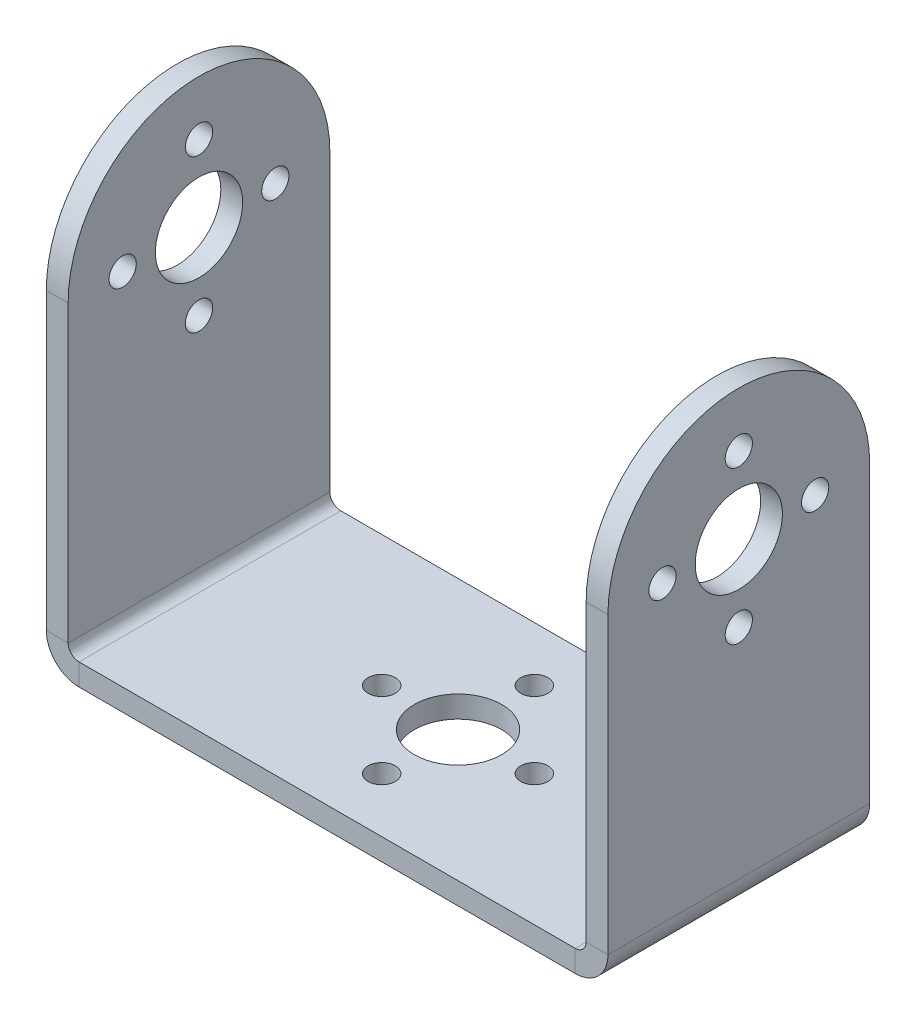
ISO-10303-21;
HEADER;
FILE_DESCRIPTION(('STEP AP214'),'2;1');
FILE_NAME('part.step','',(''),(''),'','','');
FILE_SCHEMA(('AUTOMOTIVE_DESIGN { 1 0 10303 214 1 1 1 1 }'));
ENDSEC;
DATA;
#1=APPLICATION_CONTEXT('core data for automotive mechanical design processes');
#2=APPLICATION_PROTOCOL_DEFINITION('international standard','automotive_design',2000,#1);
#3=PRODUCT_CONTEXT('',#1,'mechanical');
#4=PRODUCT('Part','Part','',(#3));
#5=PRODUCT_RELATED_PRODUCT_CATEGORY('part','',(#4));
#6=PRODUCT_DEFINITION_FORMATION('','',#4);
#7=PRODUCT_DEFINITION_CONTEXT('part definition',#1,'design');
#8=PRODUCT_DEFINITION('design','',#6,#7);
#9=PRODUCT_DEFINITION_SHAPE('','',#8);
#10=(LENGTH_UNIT() NAMED_UNIT(*) SI_UNIT(.MILLI.,.METRE.));
#11=(NAMED_UNIT(*) PLANE_ANGLE_UNIT() SI_UNIT($,.RADIAN.));
#12=(NAMED_UNIT(*) SI_UNIT($,.STERADIAN.) SOLID_ANGLE_UNIT());
#13=UNCERTAINTY_MEASURE_WITH_UNIT(LENGTH_MEASURE(1.E-05),#10,'distance_accuracy_value','');
#14=(GEOMETRIC_REPRESENTATION_CONTEXT(3) GLOBAL_UNCERTAINTY_ASSIGNED_CONTEXT((#13)) GLOBAL_UNIT_ASSIGNED_CONTEXT((#10,
#11,#12)) REPRESENTATION_CONTEXT('',''));
#15=CARTESIAN_POINT('',(0.,0.,0.));
#16=DIRECTION('',(0.,0.,1.));
#17=DIRECTION('',(1.,0.,0.));
#18=AXIS2_PLACEMENT_3D('',#15,#16,#17);
#19=CARTESIAN_POINT('',(25.75,0.,12.));
#20=DIRECTION('',(-1.,0.,0.));
#21=DIRECTION('',(0.,0.,1.));
#22=AXIS2_PLACEMENT_3D('',#19,#20,#21);
#23=PLANE('',#22);
#24=CARTESIAN_POINT('',(25.75,37.,0.));
#25=DIRECTION('',(1.,0.,0.));
#26=DIRECTION('',(0.,0.,-1.));
#27=AXIS2_PLACEMENT_3D('',#24,#25,#26);
#28=CIRCLE('',#27,1.25);
#29=CARTESIAN_POINT('',(25.75,37.,-1.25));
#30=VERTEX_POINT('',#29);
#31=EDGE_CURVE('E353',#30,#30,#28,.T.);
#32=ORIENTED_EDGE('',*,*,#31,.F.);
#33=EDGE_LOOP('',(#32));
#34=FACE_BOUND('',#33,.T.);
#35=CARTESIAN_POINT('',(25.75,30.,-7.));
#36=DIRECTION('',(1.,0.,0.));
#37=DIRECTION('',(0.,0.,-1.));
#38=AXIS2_PLACEMENT_3D('',#35,#36,#37);
#39=CIRCLE('',#38,1.25);
#40=CARTESIAN_POINT('',(25.75,30.,-8.25));
#41=VERTEX_POINT('',#40);
#42=EDGE_CURVE('E341',#41,#41,#39,.T.);
#43=ORIENTED_EDGE('',*,*,#42,.F.);
#44=EDGE_LOOP('',(#43));
#45=FACE_BOUND('',#44,.T.);
#46=CARTESIAN_POINT('',(25.75,23.,0.));
#47=DIRECTION('',(1.,0.,0.));
#48=DIRECTION('',(0.,0.,-1.));
#49=AXIS2_PLACEMENT_3D('',#46,#47,#48);
#50=CIRCLE('',#49,1.25);
#51=CARTESIAN_POINT('',(25.75,23.,-1.25));
#52=VERTEX_POINT('',#51);
#53=EDGE_CURVE('E329',#52,#52,#50,.T.);
#54=ORIENTED_EDGE('',*,*,#53,.F.);
#55=EDGE_LOOP('',(#54));
#56=FACE_BOUND('',#55,.T.);
#57=CARTESIAN_POINT('',(25.75,30.,7.));
#58=DIRECTION('',(1.,0.,0.));
#59=DIRECTION('',(0.,0.,-1.));
#60=AXIS2_PLACEMENT_3D('',#57,#58,#59);
#61=CIRCLE('',#60,1.25);
#62=CARTESIAN_POINT('',(25.75,30.,5.75));
#63=VERTEX_POINT('',#62);
#64=EDGE_CURVE('E317',#63,#63,#61,.T.);
#65=ORIENTED_EDGE('',*,*,#64,.F.);
#66=EDGE_LOOP('',(#65));
#67=FACE_BOUND('',#66,.T.);
#68=CARTESIAN_POINT('',(25.75,30.,0.));
#69=DIRECTION('',(1.,0.,0.));
#70=DIRECTION('',(0.,0.,-1.));
#71=AXIS2_PLACEMENT_3D('',#68,#69,#70);
#72=CIRCLE('',#71,4.);
#73=CARTESIAN_POINT('',(25.75,30.,-4.));
#74=VERTEX_POINT('',#73);
#75=EDGE_CURVE('E305',#74,#74,#72,.T.);
#76=ORIENTED_EDGE('',*,*,#75,.F.);
#77=EDGE_LOOP('',(#76));
#78=FACE_BOUND('',#77,.T.);
#79=DIRECTION('',(0.,1.,0.));
#80=VECTOR('',#79,1.);
#81=CARTESIAN_POINT('',(25.75,0.,-12.));
#82=LINE('',#81,#80);
#83=CARTESIAN_POINT('',(25.75,3.,-12.));
#84=VERTEX_POINT('',#83);
#85=CARTESIAN_POINT('',(25.75,30.,-12.));
#86=VERTEX_POINT('',#85);
#87=EDGE_CURVE('E162',#84,#86,#82,.T.);
#88=ORIENTED_EDGE('',*,*,#87,.T.);
#89=CARTESIAN_POINT('',(25.75,30.,0.));
#90=DIRECTION('',(-1.,0.,0.));
#91=DIRECTION('',(0.,0.,1.));
#92=AXIS2_PLACEMENT_3D('',#89,#90,#91);
#93=CIRCLE('',#92,12.);
#94=CARTESIAN_POINT('',(25.75,30.,12.));
#95=VERTEX_POINT('',#94);
#96=EDGE_CURVE('E270',#86,#95,#93,.F.);
#97=ORIENTED_EDGE('',*,*,#96,.T.);
#98=DIRECTION('',(0.,1.,0.));
#99=VECTOR('',#98,1.);
#100=CARTESIAN_POINT('',(25.75,0.,12.));
#101=LINE('',#100,#99);
#102=CARTESIAN_POINT('',(25.75,3.,12.));
#103=VERTEX_POINT('',#102);
#104=EDGE_CURVE('E186',#103,#95,#101,.T.);
#105=ORIENTED_EDGE('',*,*,#104,.F.);
#106=DIRECTION('',(0.,0.,-1.));
#107=VECTOR('',#106,1.);
#108=CARTESIAN_POINT('',(25.75,3.,12.));
#109=LINE('',#108,#107);
#110=EDGE_CURVE('E158',#103,#84,#109,.T.);
#111=ORIENTED_EDGE('',*,*,#110,.T.);
#112=EDGE_LOOP('',(#88,#97,#105,#111));
#113=FACE_BOUND('',#112,.T.);
#114=ADVANCED_FACE('F37',(#34,#45,#56,#67,#78,#113),#23,.F.);
#115=CARTESIAN_POINT('',(23.75,0.,12.));
#116=DIRECTION('',(-1.,0.,0.));
#117=DIRECTION('',(0.,0.,1.));
#118=AXIS2_PLACEMENT_3D('',#115,#116,#117);
#119=PLANE('',#118);
#120=CARTESIAN_POINT('',(23.75,37.,0.));
#121=DIRECTION('',(-1.,0.,0.));
#122=DIRECTION('',(0.,0.,1.));
#123=AXIS2_PLACEMENT_3D('',#120,#121,#122);
#124=CIRCLE('',#123,1.24999999999999);
#125=CARTESIAN_POINT('',(23.75,37.,1.24999999999999));
#126=VERTEX_POINT('',#125);
#127=EDGE_CURVE('E344',#126,#126,#124,.T.);
#128=ORIENTED_EDGE('',*,*,#127,.F.);
#129=EDGE_LOOP('',(#128));
#130=FACE_BOUND('',#129,.T.);
#131=CARTESIAN_POINT('',(23.75,30.,-7.));
#132=DIRECTION('',(-1.,0.,0.));
#133=DIRECTION('',(0.,0.,1.));
#134=AXIS2_PLACEMENT_3D('',#131,#132,#133);
#135=CIRCLE('',#134,1.24999999999999);
#136=CARTESIAN_POINT('',(23.75,30.,-5.75000000000001));
#137=VERTEX_POINT('',#136);
#138=EDGE_CURVE('E335',#137,#137,#135,.T.);
#139=ORIENTED_EDGE('',*,*,#138,.F.);
#140=EDGE_LOOP('',(#139));
#141=FACE_BOUND('',#140,.T.);
#142=CARTESIAN_POINT('',(23.75,23.,0.));
#143=DIRECTION('',(-1.,0.,0.));
#144=DIRECTION('',(0.,0.,1.));
#145=AXIS2_PLACEMENT_3D('',#142,#143,#144);
#146=CIRCLE('',#145,1.24999999999999);
#147=CARTESIAN_POINT('',(23.75,23.,1.24999999999999));
#148=VERTEX_POINT('',#147);
#149=EDGE_CURVE('E320',#148,#148,#146,.T.);
#150=ORIENTED_EDGE('',*,*,#149,.F.);
#151=EDGE_LOOP('',(#150));
#152=FACE_BOUND('',#151,.T.);
#153=CARTESIAN_POINT('',(23.75,30.,7.));
#154=DIRECTION('',(-1.,0.,0.));
#155=DIRECTION('',(0.,0.,1.));
#156=AXIS2_PLACEMENT_3D('',#153,#154,#155);
#157=CIRCLE('',#156,1.24999999999999);
#158=CARTESIAN_POINT('',(23.75,30.,8.24999999999999));
#159=VERTEX_POINT('',#158);
#160=EDGE_CURVE('E311',#159,#159,#157,.T.);
#161=ORIENTED_EDGE('',*,*,#160,.F.);
#162=EDGE_LOOP('',(#161));
#163=FACE_BOUND('',#162,.T.);
#164=CARTESIAN_POINT('',(23.75,30.,0.));
#165=DIRECTION('',(-1.,0.,0.));
#166=DIRECTION('',(0.,0.,1.));
#167=AXIS2_PLACEMENT_3D('',#164,#165,#166);
#168=CIRCLE('',#167,3.99999999999999);
#169=CARTESIAN_POINT('',(23.75,30.,3.99999999999999));
#170=VERTEX_POINT('',#169);
#171=EDGE_CURVE('E299',#170,#170,#168,.T.);
#172=ORIENTED_EDGE('',*,*,#171,.F.);
#173=EDGE_LOOP('',(#172));
#174=FACE_BOUND('',#173,.T.);
#175=CARTESIAN_POINT('',(23.75,30.,0.));
#176=DIRECTION('',(-1.,0.,0.));
#177=DIRECTION('',(0.,0.,1.));
#178=AXIS2_PLACEMENT_3D('',#175,#176,#177);
#179=CIRCLE('',#178,12.);
#180=CARTESIAN_POINT('',(23.75,30.,-12.));
#181=VERTEX_POINT('',#180);
#182=CARTESIAN_POINT('',(23.75,30.,12.));
#183=VERTEX_POINT('',#182);
#184=EDGE_CURVE('E52',#181,#183,#179,.F.);
#185=ORIENTED_EDGE('',*,*,#184,.F.);
#186=DIRECTION('',(0.,1.,0.));
#187=VECTOR('',#186,1.);
#188=CARTESIAN_POINT('',(23.75,0.,-12.));
#189=LINE('',#188,#187);
#190=CARTESIAN_POINT('',(23.75,3.,-12.));
#191=VERTEX_POINT('',#190);
#192=EDGE_CURVE('E165',#191,#181,#189,.T.);
#193=ORIENTED_EDGE('',*,*,#192,.F.);
#194=DIRECTION('',(0.,0.,-1.));
#195=VECTOR('',#194,1.);
#196=CARTESIAN_POINT('',(23.75,3.,12.));
#197=LINE('',#196,#195);
#198=CARTESIAN_POINT('',(23.75,3.,12.));
#199=VERTEX_POINT('',#198);
#200=EDGE_CURVE('E200',#199,#191,#197,.T.);
#201=ORIENTED_EDGE('',*,*,#200,.F.);
#202=DIRECTION('',(0.,1.,0.));
#203=VECTOR('',#202,1.);
#204=CARTESIAN_POINT('',(23.75,0.,12.));
#205=LINE('',#204,#203);
#206=EDGE_CURVE('E268',#199,#183,#205,.T.);
#207=ORIENTED_EDGE('',*,*,#206,.T.);
#208=EDGE_LOOP('',(#185,#193,#201,#207));
#209=FACE_BOUND('',#208,.T.);
#210=ADVANCED_FACE('F267',(#130,#141,#152,#163,#174,#209),#119,.T.);
#211=CARTESIAN_POINT('',(-23.75,42.,12.));
#212=DIRECTION('',(1.,0.,0.));
#213=DIRECTION('',(0.,0.,-1.));
#214=AXIS2_PLACEMENT_3D('',#211,#212,#213);
#215=PLANE('',#214);
#216=CARTESIAN_POINT('',(-23.75,37.,0.));
#217=DIRECTION('',(1.,0.,0.));
#218=DIRECTION('',(0.,0.,-1.));
#219=AXIS2_PLACEMENT_3D('',#216,#217,#218);
#220=CIRCLE('',#219,1.24999999999999);
#221=CARTESIAN_POINT('',(-23.75,37.,-1.24999999999999));
#222=VERTEX_POINT('',#221);
#223=EDGE_CURVE('E347',#222,#222,#220,.T.);
#224=ORIENTED_EDGE('',*,*,#223,.F.);
#225=EDGE_LOOP('',(#224));
#226=FACE_BOUND('',#225,.T.);
#227=CARTESIAN_POINT('',(-23.75,30.,-7.));
#228=DIRECTION('',(1.,0.,0.));
#229=DIRECTION('',(0.,0.,-1.));
#230=AXIS2_PLACEMENT_3D('',#227,#228,#229);
#231=CIRCLE('',#230,1.24999999999999);
#232=CARTESIAN_POINT('',(-23.75,30.,-8.24999999999999));
#233=VERTEX_POINT('',#232);
#234=EDGE_CURVE('E332',#233,#233,#231,.T.);
#235=ORIENTED_EDGE('',*,*,#234,.F.);
#236=EDGE_LOOP('',(#235));
#237=FACE_BOUND('',#236,.T.);
#238=CARTESIAN_POINT('',(-23.75,23.,0.));
#239=DIRECTION('',(1.,0.,0.));
#240=DIRECTION('',(0.,0.,-1.));
#241=AXIS2_PLACEMENT_3D('',#238,#239,#240);
#242=CIRCLE('',#241,1.24999999999999);
#243=CARTESIAN_POINT('',(-23.75,23.,-1.24999999999999));
#244=VERTEX_POINT('',#243);
#245=EDGE_CURVE('E323',#244,#244,#242,.T.);
#246=ORIENTED_EDGE('',*,*,#245,.F.);
#247=EDGE_LOOP('',(#246));
#248=FACE_BOUND('',#247,.T.);
#249=CARTESIAN_POINT('',(-23.75,30.,7.));
#250=DIRECTION('',(1.,0.,0.));
#251=DIRECTION('',(0.,0.,-1.));
#252=AXIS2_PLACEMENT_3D('',#249,#250,#251);
#253=CIRCLE('',#252,1.24999999999999);
#254=CARTESIAN_POINT('',(-23.75,30.,5.75000000000001));
#255=VERTEX_POINT('',#254);
#256=EDGE_CURVE('E308',#255,#255,#253,.T.);
#257=ORIENTED_EDGE('',*,*,#256,.F.);
#258=EDGE_LOOP('',(#257));
#259=FACE_BOUND('',#258,.T.);
#260=CARTESIAN_POINT('',(-23.75,30.,0.));
#261=DIRECTION('',(1.,0.,0.));
#262=DIRECTION('',(0.,0.,-1.));
#263=AXIS2_PLACEMENT_3D('',#260,#261,#262);
#264=CIRCLE('',#263,3.99999999999999);
#265=CARTESIAN_POINT('',(-23.75,30.,-3.99999999999999));
#266=VERTEX_POINT('',#265);
#267=EDGE_CURVE('E279',#266,#266,#264,.T.);
#268=ORIENTED_EDGE('',*,*,#267,.F.);
#269=EDGE_LOOP('',(#268));
#270=FACE_BOUND('',#269,.T.);
#271=DIRECTION('',(0.,1.,0.));
#272=VECTOR('',#271,1.);
#273=CARTESIAN_POINT('',(-23.75,42.,-12.));
#274=LINE('',#273,#272);
#275=CARTESIAN_POINT('',(-23.75,30.,-12.));
#276=VERTEX_POINT('',#275);
#277=CARTESIAN_POINT('',(-23.75,3.00000000000002,-12.));
#278=VERTEX_POINT('',#277);
#279=EDGE_CURVE('E177',#276,#278,#274,.F.);
#280=ORIENTED_EDGE('',*,*,#279,.F.);
#281=CARTESIAN_POINT('',(-23.75,30.,0.));
#282=DIRECTION('',(1.,0.,0.));
#283=DIRECTION('',(0.,0.,-1.));
#284=AXIS2_PLACEMENT_3D('',#281,#282,#283);
#285=CIRCLE('',#284,12.);
#286=CARTESIAN_POINT('',(-23.75,30.,12.));
#287=VERTEX_POINT('',#286);
#288=EDGE_CURVE('E290',#287,#276,#285,.F.);
#289=ORIENTED_EDGE('',*,*,#288,.F.);
#290=DIRECTION('',(0.,1.,0.));
#291=VECTOR('',#290,1.);
#292=CARTESIAN_POINT('',(-23.75,42.,12.));
#293=LINE('',#292,#291);
#294=CARTESIAN_POINT('',(-23.75,3.00000000000002,12.));
#295=VERTEX_POINT('',#294);
#296=EDGE_CURVE('E235',#287,#295,#293,.F.);
#297=ORIENTED_EDGE('',*,*,#296,.T.);
#298=DIRECTION('',(0.,0.,-1.));
#299=VECTOR('',#298,1.);
#300=CARTESIAN_POINT('',(-23.75,3.00000000000002,12.));
#301=LINE('',#300,#299);
#302=EDGE_CURVE('E191',#295,#278,#301,.T.);
#303=ORIENTED_EDGE('',*,*,#302,.T.);
#304=EDGE_LOOP('',(#280,#289,#297,#303));
#305=FACE_BOUND('',#304,.T.);
#306=ADVANCED_FACE('F231',(#226,#237,#248,#259,#270,#305),#215,.T.);
#307=CARTESIAN_POINT('',(-25.75,42.,12.));
#308=DIRECTION('',(1.,0.,0.));
#309=DIRECTION('',(0.,0.,-1.));
#310=AXIS2_PLACEMENT_3D('',#307,#308,#309);
#311=PLANE('',#310);
#312=CARTESIAN_POINT('',(-25.75,37.,0.));
#313=DIRECTION('',(1.,0.,0.));
#314=DIRECTION('',(0.,0.,-1.));
#315=AXIS2_PLACEMENT_3D('',#312,#313,#314);
#316=CIRCLE('',#315,1.24999999999999);
#317=CARTESIAN_POINT('',(-25.75,37.,-1.24999999999999));
#318=VERTEX_POINT('',#317);
#319=EDGE_CURVE('E350',#318,#318,#316,.T.);
#320=ORIENTED_EDGE('',*,*,#319,.T.);
#321=EDGE_LOOP('',(#320));
#322=FACE_BOUND('',#321,.T.);
#323=CARTESIAN_POINT('',(-25.75,30.,-7.));
#324=DIRECTION('',(1.,0.,0.));
#325=DIRECTION('',(0.,0.,-1.));
#326=AXIS2_PLACEMENT_3D('',#323,#324,#325);
#327=CIRCLE('',#326,1.24999999999999);
#328=CARTESIAN_POINT('',(-25.75,30.,-8.24999999999999));
#329=VERTEX_POINT('',#328);
#330=EDGE_CURVE('E338',#329,#329,#327,.T.);
#331=ORIENTED_EDGE('',*,*,#330,.T.);
#332=EDGE_LOOP('',(#331));
#333=FACE_BOUND('',#332,.T.);
#334=CARTESIAN_POINT('',(-25.75,23.,0.));
#335=DIRECTION('',(1.,0.,0.));
#336=DIRECTION('',(0.,0.,-1.));
#337=AXIS2_PLACEMENT_3D('',#334,#335,#336);
#338=CIRCLE('',#337,1.24999999999999);
#339=CARTESIAN_POINT('',(-25.75,23.,-1.24999999999999));
#340=VERTEX_POINT('',#339);
#341=EDGE_CURVE('E326',#340,#340,#338,.T.);
#342=ORIENTED_EDGE('',*,*,#341,.T.);
#343=EDGE_LOOP('',(#342));
#344=FACE_BOUND('',#343,.T.);
#345=CARTESIAN_POINT('',(-25.75,30.,7.));
#346=DIRECTION('',(1.,0.,0.));
#347=DIRECTION('',(0.,0.,-1.));
#348=AXIS2_PLACEMENT_3D('',#345,#346,#347);
#349=CIRCLE('',#348,1.24999999999999);
#350=CARTESIAN_POINT('',(-25.75,30.,5.75000000000001));
#351=VERTEX_POINT('',#350);
#352=EDGE_CURVE('E314',#351,#351,#349,.T.);
#353=ORIENTED_EDGE('',*,*,#352,.T.);
#354=EDGE_LOOP('',(#353));
#355=FACE_BOUND('',#354,.T.);
#356=CARTESIAN_POINT('',(-25.75,30.,0.));
#357=DIRECTION('',(1.,0.,0.));
#358=DIRECTION('',(0.,0.,-1.));
#359=AXIS2_PLACEMENT_3D('',#356,#357,#358);
#360=CIRCLE('',#359,3.99999999999999);
#361=CARTESIAN_POINT('',(-25.75,30.,-3.99999999999999));
#362=VERTEX_POINT('',#361);
#363=EDGE_CURVE('E302',#362,#362,#360,.T.);
#364=ORIENTED_EDGE('',*,*,#363,.T.);
#365=EDGE_LOOP('',(#364));
#366=FACE_BOUND('',#365,.T.);
#367=CARTESIAN_POINT('',(-25.75,30.,0.));
#368=DIRECTION('',(1.,0.,0.));
#369=DIRECTION('',(0.,0.,-1.));
#370=AXIS2_PLACEMENT_3D('',#367,#368,#369);
#371=CIRCLE('',#370,12.);
#372=CARTESIAN_POINT('',(-25.75,30.,12.));
#373=VERTEX_POINT('',#372);
#374=CARTESIAN_POINT('',(-25.75,30.,-12.));
#375=VERTEX_POINT('',#374);
#376=EDGE_CURVE('E251',#373,#375,#371,.F.);
#377=ORIENTED_EDGE('',*,*,#376,.T.);
#378=DIRECTION('',(0.,-1.,0.));
#379=VECTOR('',#378,1.);
#380=CARTESIAN_POINT('',(-25.75,42.,-12.));
#381=LINE('',#380,#379);
#382=CARTESIAN_POINT('',(-25.75,3.00000000000004,-12.));
#383=VERTEX_POINT('',#382);
#384=EDGE_CURVE('E179',#375,#383,#381,.T.);
#385=ORIENTED_EDGE('',*,*,#384,.T.);
#386=DIRECTION('',(0.,0.,-1.));
#387=VECTOR('',#386,1.);
#388=CARTESIAN_POINT('',(-25.75,3.00000000000004,12.));
#389=LINE('',#388,#387);
#390=CARTESIAN_POINT('',(-25.75,3.00000000000004,12.));
#391=VERTEX_POINT('',#390);
#392=EDGE_CURVE('E150',#391,#383,#389,.T.);
#393=ORIENTED_EDGE('',*,*,#392,.F.);
#394=DIRECTION('',(0.,-1.,0.));
#395=VECTOR('',#394,1.);
#396=CARTESIAN_POINT('',(-25.75,42.,12.));
#397=LINE('',#396,#395);
#398=EDGE_CURVE('E139',#373,#391,#397,.T.);
#399=ORIENTED_EDGE('',*,*,#398,.F.);
#400=EDGE_LOOP('',(#377,#385,#393,#399));
#401=FACE_BOUND('',#400,.T.);
#402=ADVANCED_FACE('F248',(#322,#333,#344,#355,#366,#401),#311,.F.);
#403=CARTESIAN_POINT('',(22.75,3.,12.));
#404=DIRECTION('',(0.,0.,1.));
#405=DIRECTION('',(1.,0.,0.));
#406=AXIS2_PLACEMENT_3D('',#403,#404,#405);
#407=PLANE('',#406);
#408=ORIENTED_EDGE('',*,*,#104,.T.);
#409=DIRECTION('',(1.,0.,0.));
#410=VECTOR('',#409,1.);
#411=CARTESIAN_POINT('',(25.75,30.,12.));
#412=LINE('',#411,#410);
#413=EDGE_CURVE('E269',#95,#183,#412,.F.);
#414=ORIENTED_EDGE('',*,*,#413,.T.);
#415=ORIENTED_EDGE('',*,*,#206,.F.);
#416=DIRECTION('',(1.,0.,0.));
#417=VECTOR('',#416,1.);
#418=CARTESIAN_POINT('',(23.75,3.,12.));
#419=LINE('',#418,#417);
#420=EDGE_CURVE('E61',#199,#103,#419,.T.);
#421=ORIENTED_EDGE('',*,*,#420,.T.);
#422=EDGE_LOOP('',(#408,#414,#415,#421));
#423=FACE_BOUND('',#422,.T.);
#424=ADVANCED_FACE('F285',(#423),#407,.T.);
#425=CARTESIAN_POINT('',(-25.75,3.00000000000004,12.));
#426=DIRECTION('',(0.,0.,1.));
#427=DIRECTION('',(1.,0.,0.));
#428=AXIS2_PLACEMENT_3D('',#425,#426,#427);
#429=PLANE('',#428);
#430=DIRECTION('',(1.,0.,0.));
#431=VECTOR('',#430,1.);
#432=CARTESIAN_POINT('',(-25.75,3.00000000000004,12.));
#433=LINE('',#432,#431);
#434=EDGE_CURVE('E11',#391,#295,#433,.T.);
#435=ORIENTED_EDGE('',*,*,#434,.F.);
#436=CARTESIAN_POINT('',(-22.75,3.00000000000001,12.));
#437=DIRECTION('',(0.,0.,-1.));
#438=DIRECTION('',(-1.,0.,0.));
#439=AXIS2_PLACEMENT_3D('',#436,#437,#438);
#440=CIRCLE('',#439,3.);
#441=CARTESIAN_POINT('',(-22.75,0.,12.));
#442=VERTEX_POINT('',#441);
#443=EDGE_CURVE('E134',#391,#442,#440,.F.);
#444=ORIENTED_EDGE('',*,*,#443,.T.);
#445=DIRECTION('',(0.,-1.,0.));
#446=VECTOR('',#445,1.);
#447=CARTESIAN_POINT('',(-22.75,2.,12.));
#448=LINE('',#447,#446);
#449=CARTESIAN_POINT('',(-22.75,2.,12.));
#450=VERTEX_POINT('',#449);
#451=EDGE_CURVE('E45',#450,#442,#448,.T.);
#452=ORIENTED_EDGE('',*,*,#451,.F.);
#453=CARTESIAN_POINT('',(-22.75,3.00000000000001,12.));
#454=DIRECTION('',(0.,0.,1.));
#455=DIRECTION('',(1.,0.,0.));
#456=AXIS2_PLACEMENT_3D('',#453,#454,#455);
#457=CIRCLE('',#456,1.);
#458=EDGE_CURVE('E220',#295,#450,#457,.T.);
#459=ORIENTED_EDGE('',*,*,#458,.F.);
#460=EDGE_LOOP('',(#435,#444,#452,#459));
#461=FACE_BOUND('',#460,.T.);
#462=ADVANCED_FACE('F39',(#461),#429,.T.);
#463=CARTESIAN_POINT('',(-22.75,2.,12.));
#464=DIRECTION('',(0.,0.,1.));
#465=DIRECTION('',(1.,0.,0.));
#466=AXIS2_PLACEMENT_3D('',#463,#464,#465);
#467=PLANE('',#466);
#468=DIRECTION('',(1.,0.,0.));
#469=VECTOR('',#468,1.);
#470=CARTESIAN_POINT('',(-23.75,30.,12.));
#471=LINE('',#470,#469);
#472=EDGE_CURVE('E166',#287,#373,#471,.F.);
#473=ORIENTED_EDGE('',*,*,#472,.T.);
#474=ORIENTED_EDGE('',*,*,#398,.T.);
#475=ORIENTED_EDGE('',*,*,#434,.T.);
#476=ORIENTED_EDGE('',*,*,#296,.F.);
#477=EDGE_LOOP('',(#473,#474,#475,#476));
#478=FACE_BOUND('',#477,.T.);
#479=ADVANCED_FACE('F244',(#478),#467,.T.);
#480=CARTESIAN_POINT('',(-22.75,0.,-12.));
#481=DIRECTION('',(0.,0.,-1.));
#482=DIRECTION('',(-1.,0.,0.));
#483=AXIS2_PLACEMENT_3D('',#480,#481,#482);
#484=PLANE('',#483);
#485=DIRECTION('',(0.,1.,0.));
#486=VECTOR('',#485,1.);
#487=CARTESIAN_POINT('',(-22.75,0.,-12.));
#488=LINE('',#487,#486);
#489=CARTESIAN_POINT('',(-22.75,0.,-12.));
#490=VERTEX_POINT('',#489);
#491=CARTESIAN_POINT('',(-22.75,2.,-12.));
#492=VERTEX_POINT('',#491);
#493=EDGE_CURVE('E131',#490,#492,#488,.T.);
#494=ORIENTED_EDGE('',*,*,#493,.F.);
#495=CARTESIAN_POINT('',(-22.75,3.00000000000001,-12.));
#496=DIRECTION('',(0.,0.,-1.));
#497=DIRECTION('',(-1.,0.,0.));
#498=AXIS2_PLACEMENT_3D('',#495,#496,#497);
#499=CIRCLE('',#498,3.);
#500=EDGE_CURVE('E146',#383,#490,#499,.F.);
#501=ORIENTED_EDGE('',*,*,#500,.F.);
#502=DIRECTION('',(-1.,0.,0.));
#503=VECTOR('',#502,1.);
#504=CARTESIAN_POINT('',(-23.75,3.00000000000002,-12.));
#505=LINE('',#504,#503);
#506=EDGE_CURVE('E209',#278,#383,#505,.T.);
#507=ORIENTED_EDGE('',*,*,#506,.F.);
#508=CARTESIAN_POINT('',(-22.75,3.00000000000001,-12.));
#509=DIRECTION('',(0.,0.,1.));
#510=DIRECTION('',(1.,0.,0.));
#511=AXIS2_PLACEMENT_3D('',#508,#509,#510);
#512=CIRCLE('',#511,1.);
#513=EDGE_CURVE('E174',#278,#492,#512,.T.);
#514=ORIENTED_EDGE('',*,*,#513,.T.);
#515=EDGE_LOOP('',(#494,#501,#507,#514));
#516=FACE_BOUND('',#515,.T.);
#517=ADVANCED_FACE('F226',(#516),#484,.T.);
#518=CARTESIAN_POINT('',(-23.75,3.00000000000002,-12.));
#519=DIRECTION('',(0.,0.,-1.));
#520=DIRECTION('',(-1.,0.,0.));
#521=AXIS2_PLACEMENT_3D('',#518,#519,#520);
#522=PLANE('',#521);
#523=DIRECTION('',(1.,0.,0.));
#524=VECTOR('',#523,1.);
#525=CARTESIAN_POINT('',(-25.75,0.,-12.));
#526=LINE('',#525,#524);
#527=CARTESIAN_POINT('',(22.75,0.,-12.));
#528=VERTEX_POINT('',#527);
#529=EDGE_CURVE('E182',#490,#528,#526,.T.);
#530=ORIENTED_EDGE('',*,*,#529,.F.);
#531=ORIENTED_EDGE('',*,*,#493,.T.);
#532=DIRECTION('',(1.,0.,0.));
#533=VECTOR('',#532,1.);
#534=CARTESIAN_POINT('',(-25.75,2.,-12.));
#535=LINE('',#534,#533);
#536=CARTESIAN_POINT('',(22.75,2.,-12.));
#537=VERTEX_POINT('',#536);
#538=EDGE_CURVE('E171',#492,#537,#535,.T.);
#539=ORIENTED_EDGE('',*,*,#538,.T.);
#540=DIRECTION('',(0.,-1.,0.));
#541=VECTOR('',#540,1.);
#542=CARTESIAN_POINT('',(22.75,2.,-12.));
#543=LINE('',#542,#541);
#544=EDGE_CURVE('E203',#537,#528,#543,.T.);
#545=ORIENTED_EDGE('',*,*,#544,.T.);
#546=EDGE_LOOP('',(#530,#531,#539,#545));
#547=FACE_BOUND('',#546,.T.);
#548=ADVANCED_FACE('F213',(#547),#522,.T.);
#549=CARTESIAN_POINT('',(22.75,0.,12.));
#550=DIRECTION('',(0.,0.,1.));
#551=DIRECTION('',(1.,0.,0.));
#552=AXIS2_PLACEMENT_3D('',#549,#550,#551);
#553=PLANE('',#552);
#554=DIRECTION('',(0.,1.,0.));
#555=VECTOR('',#554,1.);
#556=CARTESIAN_POINT('',(22.75,0.,12.));
#557=LINE('',#556,#555);
#558=CARTESIAN_POINT('',(22.75,0.,12.));
#559=VERTEX_POINT('',#558);
#560=CARTESIAN_POINT('',(22.75,2.,12.));
#561=VERTEX_POINT('',#560);
#562=EDGE_CURVE('E207',#559,#561,#557,.T.);
#563=ORIENTED_EDGE('',*,*,#562,.F.);
#564=CARTESIAN_POINT('',(22.75,3.,12.));
#565=DIRECTION('',(0.,0.,-1.));
#566=DIRECTION('',(-1.,0.,0.));
#567=AXIS2_PLACEMENT_3D('',#564,#565,#566);
#568=CIRCLE('',#567,3.);
#569=EDGE_CURVE('E156',#559,#103,#568,.F.);
#570=ORIENTED_EDGE('',*,*,#569,.T.);
#571=ORIENTED_EDGE('',*,*,#420,.F.);
#572=CARTESIAN_POINT('',(22.75,3.,12.));
#573=DIRECTION('',(0.,0.,1.));
#574=DIRECTION('',(1.,0.,0.));
#575=AXIS2_PLACEMENT_3D('',#572,#573,#574);
#576=CIRCLE('',#575,1.);
#577=EDGE_CURVE('E238',#561,#199,#576,.T.);
#578=ORIENTED_EDGE('',*,*,#577,.F.);
#579=EDGE_LOOP('',(#563,#570,#571,#578));
#580=FACE_BOUND('',#579,.T.);
#581=ADVANCED_FACE('F436',(#580),#553,.T.);
#582=CARTESIAN_POINT('',(23.75,3.,12.));
#583=DIRECTION('',(0.,0.,1.));
#584=DIRECTION('',(1.,0.,0.));
#585=AXIS2_PLACEMENT_3D('',#582,#583,#584);
#586=PLANE('',#585);
#587=DIRECTION('',(1.,0.,0.));
#588=VECTOR('',#587,1.);
#589=CARTESIAN_POINT('',(-25.75,0.,12.));
#590=LINE('',#589,#588);
#591=EDGE_CURVE('E123',#442,#559,#590,.T.);
#592=ORIENTED_EDGE('',*,*,#591,.T.);
#593=ORIENTED_EDGE('',*,*,#562,.T.);
#594=DIRECTION('',(1.,0.,0.));
#595=VECTOR('',#594,1.);
#596=CARTESIAN_POINT('',(-25.75,2.,12.));
#597=LINE('',#596,#595);
#598=EDGE_CURVE('E126',#450,#561,#597,.T.);
#599=ORIENTED_EDGE('',*,*,#598,.F.);
#600=ORIENTED_EDGE('',*,*,#451,.T.);
#601=EDGE_LOOP('',(#592,#593,#599,#600));
#602=FACE_BOUND('',#601,.T.);
#603=ADVANCED_FACE('F121',(#602),#586,.T.);
#604=CARTESIAN_POINT('',(25.75,3.,-12.));
#605=DIRECTION('',(0.,0.,-1.));
#606=DIRECTION('',(-1.,0.,0.));
#607=AXIS2_PLACEMENT_3D('',#604,#605,#606);
#608=PLANE('',#607);
#609=DIRECTION('',(-1.,0.,0.));
#610=VECTOR('',#609,1.);
#611=CARTESIAN_POINT('',(25.75,3.,-12.));
#612=LINE('',#611,#610);
#613=EDGE_CURVE('E95',#84,#191,#612,.T.);
#614=ORIENTED_EDGE('',*,*,#613,.F.);
#615=CARTESIAN_POINT('',(22.75,3.,-12.));
#616=DIRECTION('',(0.,0.,-1.));
#617=DIRECTION('',(-1.,0.,0.));
#618=AXIS2_PLACEMENT_3D('',#615,#616,#617);
#619=CIRCLE('',#618,3.);
#620=EDGE_CURVE('E184',#528,#84,#619,.F.);
#621=ORIENTED_EDGE('',*,*,#620,.F.);
#622=ORIENTED_EDGE('',*,*,#544,.F.);
#623=CARTESIAN_POINT('',(22.75,3.,-12.));
#624=DIRECTION('',(0.,0.,1.));
#625=DIRECTION('',(1.,0.,0.));
#626=AXIS2_PLACEMENT_3D('',#623,#624,#625);
#627=CIRCLE('',#626,1.);
#628=EDGE_CURVE('E169',#537,#191,#627,.T.);
#629=ORIENTED_EDGE('',*,*,#628,.T.);
#630=EDGE_LOOP('',(#614,#621,#622,#629));
#631=FACE_BOUND('',#630,.T.);
#632=ADVANCED_FACE('F431',(#631),#608,.T.);
#633=CARTESIAN_POINT('',(22.75,2.,-12.));
#634=DIRECTION('',(0.,0.,-1.));
#635=DIRECTION('',(-1.,0.,0.));
#636=AXIS2_PLACEMENT_3D('',#633,#634,#635);
#637=PLANE('',#636);
#638=DIRECTION('',(-1.,0.,0.));
#639=VECTOR('',#638,1.);
#640=CARTESIAN_POINT('',(23.75,30.,-12.));
#641=LINE('',#640,#639);
#642=EDGE_CURVE('E273',#181,#86,#641,.F.);
#643=ORIENTED_EDGE('',*,*,#642,.T.);
#644=ORIENTED_EDGE('',*,*,#87,.F.);
#645=ORIENTED_EDGE('',*,*,#613,.T.);
#646=ORIENTED_EDGE('',*,*,#192,.T.);
#647=EDGE_LOOP('',(#643,#644,#645,#646));
#648=FACE_BOUND('',#647,.T.);
#649=ADVANCED_FACE('F281',(#648),#637,.T.);
#650=CARTESIAN_POINT('',(22.75,3.,12.));
#651=DIRECTION('',(0.,0.,-1.));
#652=DIRECTION('',(-1.,0.,0.));
#653=AXIS2_PLACEMENT_3D('',#650,#651,#652);
#654=CYLINDRICAL_SURFACE('',#653,1.);
#655=ORIENTED_EDGE('',*,*,#628,.F.);
#656=DIRECTION('',(0.,0.,-1.));
#657=VECTOR('',#656,1.);
#658=CARTESIAN_POINT('',(22.75,2.,12.));
#659=LINE('',#658,#657);
#660=EDGE_CURVE('E197',#561,#537,#659,.T.);
#661=ORIENTED_EDGE('',*,*,#660,.F.);
#662=ORIENTED_EDGE('',*,*,#577,.T.);
#663=ORIENTED_EDGE('',*,*,#200,.T.);
#664=EDGE_LOOP('',(#655,#661,#662,#663));
#665=FACE_BOUND('',#664,.T.);
#666=ADVANCED_FACE('F284',(#665),#654,.F.);
#667=CARTESIAN_POINT('',(-25.75,2.,12.));
#668=DIRECTION('',(0.,1.,0.));
#669=DIRECTION('',(0.,0.,1.));
#670=AXIS2_PLACEMENT_3D('',#667,#668,#669);
#671=PLANE('',#670);
#672=CARTESIAN_POINT('',(0.,2.,-7.));
#673=DIRECTION('',(0.,1.,0.));
#674=DIRECTION('',(0.,0.,1.));
#675=AXIS2_PLACEMENT_3D('',#672,#673,#674);
#676=CIRCLE('',#675,1.25);
#677=CARTESIAN_POINT('',(0.,2.,-5.75));
#678=VERTEX_POINT('',#677);
#679=EDGE_CURVE('E383',#678,#678,#676,.T.);
#680=ORIENTED_EDGE('',*,*,#679,.F.);
#681=EDGE_LOOP('',(#680));
#682=FACE_BOUND('',#681,.T.);
#683=CARTESIAN_POINT('',(7.,2.,0.));
#684=DIRECTION('',(0.,1.,0.));
#685=DIRECTION('',(0.,0.,1.));
#686=AXIS2_PLACEMENT_3D('',#683,#684,#685);
#687=CIRCLE('',#686,1.25);
#688=CARTESIAN_POINT('',(7.,2.,1.25));
#689=VERTEX_POINT('',#688);
#690=EDGE_CURVE('E377',#689,#689,#687,.T.);
#691=ORIENTED_EDGE('',*,*,#690,.F.);
#692=EDGE_LOOP('',(#691));
#693=FACE_BOUND('',#692,.T.);
#694=CARTESIAN_POINT('',(0.,2.,7.));
#695=DIRECTION('',(0.,1.,0.));
#696=DIRECTION('',(0.,0.,1.));
#697=AXIS2_PLACEMENT_3D('',#694,#695,#696);
#698=CIRCLE('',#697,1.25);
#699=CARTESIAN_POINT('',(0.,2.,8.25));
#700=VERTEX_POINT('',#699);
#701=EDGE_CURVE('E371',#700,#700,#698,.T.);
#702=ORIENTED_EDGE('',*,*,#701,.F.);
#703=EDGE_LOOP('',(#702));
#704=FACE_BOUND('',#703,.T.);
#705=CARTESIAN_POINT('',(-7.,2.,0.));
#706=DIRECTION('',(0.,1.,0.));
#707=DIRECTION('',(0.,0.,1.));
#708=AXIS2_PLACEMENT_3D('',#705,#706,#707);
#709=CIRCLE('',#708,1.25);
#710=CARTESIAN_POINT('',(-7.,2.,1.25));
#711=VERTEX_POINT('',#710);
#712=EDGE_CURVE('E365',#711,#711,#709,.T.);
#713=ORIENTED_EDGE('',*,*,#712,.F.);
#714=EDGE_LOOP('',(#713));
#715=FACE_BOUND('',#714,.T.);
#716=CARTESIAN_POINT('',(0.,2.,0.));
#717=DIRECTION('',(0.,1.,0.));
#718=DIRECTION('',(0.,0.,1.));
#719=AXIS2_PLACEMENT_3D('',#716,#717,#718);
#720=CIRCLE('',#719,4.);
#721=CARTESIAN_POINT('',(0.,2.,4.));
#722=VERTEX_POINT('',#721);
#723=EDGE_CURVE('E359',#722,#722,#720,.T.);
#724=ORIENTED_EDGE('',*,*,#723,.F.);
#725=EDGE_LOOP('',(#724));
#726=FACE_BOUND('',#725,.T.);
#727=ORIENTED_EDGE('',*,*,#538,.F.);
#728=DIRECTION('',(0.,0.,-1.));
#729=VECTOR('',#728,1.);
#730=CARTESIAN_POINT('',(-22.75,2.,12.));
#731=LINE('',#730,#729);
#732=EDGE_CURVE('E194',#450,#492,#731,.T.);
#733=ORIENTED_EDGE('',*,*,#732,.F.);
#734=ORIENTED_EDGE('',*,*,#598,.T.);
#735=ORIENTED_EDGE('',*,*,#660,.T.);
#736=EDGE_LOOP('',(#727,#733,#734,#735));
#737=FACE_BOUND('',#736,.T.);
#738=ADVANCED_FACE('F222',(#682,#693,#704,#715,#726,#737),#671,.T.);
#739=CARTESIAN_POINT('',(-22.75,3.00000000000001,12.));
#740=DIRECTION('',(0.,0.,-1.));
#741=DIRECTION('',(-1.,0.,0.));
#742=AXIS2_PLACEMENT_3D('',#739,#740,#741);
#743=CYLINDRICAL_SURFACE('',#742,1.);
#744=ORIENTED_EDGE('',*,*,#513,.F.);
#745=ORIENTED_EDGE('',*,*,#302,.F.);
#746=ORIENTED_EDGE('',*,*,#458,.T.);
#747=ORIENTED_EDGE('',*,*,#732,.T.);
#748=EDGE_LOOP('',(#744,#745,#746,#747));
#749=FACE_BOUND('',#748,.T.);
#750=ADVANCED_FACE('F218',(#749),#743,.F.);
#751=CARTESIAN_POINT('',(-22.75,3.00000000000001,12.));
#752=DIRECTION('',(0.,0.,-1.));
#753=DIRECTION('',(-1.,0.,0.));
#754=AXIS2_PLACEMENT_3D('',#751,#752,#753);
#755=CYLINDRICAL_SURFACE('',#754,3.);
#756=ORIENTED_EDGE('',*,*,#500,.T.);
#757=DIRECTION('',(0.,0.,-1.));
#758=VECTOR('',#757,1.);
#759=CARTESIAN_POINT('',(-22.75,0.,12.));
#760=LINE('',#759,#758);
#761=EDGE_CURVE('E143',#442,#490,#760,.T.);
#762=ORIENTED_EDGE('',*,*,#761,.F.);
#763=ORIENTED_EDGE('',*,*,#443,.F.);
#764=ORIENTED_EDGE('',*,*,#392,.T.);
#765=EDGE_LOOP('',(#756,#762,#763,#764));
#766=FACE_BOUND('',#765,.T.);
#767=ADVANCED_FACE('F144',(#766),#755,.T.);
#768=CARTESIAN_POINT('',(-25.75,0.,12.));
#769=DIRECTION('',(0.,1.,0.));
#770=DIRECTION('',(0.,0.,1.));
#771=AXIS2_PLACEMENT_3D('',#768,#769,#770);
#772=PLANE('',#771);
#773=CARTESIAN_POINT('',(0.,0.,-7.));
#774=DIRECTION('',(0.,1.,0.));
#775=DIRECTION('',(0.,0.,1.));
#776=AXIS2_PLACEMENT_3D('',#773,#774,#775);
#777=CIRCLE('',#776,1.25);
#778=CARTESIAN_POINT('',(0.,0.,-5.75));
#779=VERTEX_POINT('',#778);
#780=EDGE_CURVE('E380',#779,#779,#777,.T.);
#781=ORIENTED_EDGE('',*,*,#780,.T.);
#782=EDGE_LOOP('',(#781));
#783=FACE_BOUND('',#782,.T.);
#784=CARTESIAN_POINT('',(7.,0.,0.));
#785=DIRECTION('',(0.,1.,0.));
#786=DIRECTION('',(0.,0.,1.));
#787=AXIS2_PLACEMENT_3D('',#784,#785,#786);
#788=CIRCLE('',#787,1.25);
#789=CARTESIAN_POINT('',(7.,0.,1.25));
#790=VERTEX_POINT('',#789);
#791=EDGE_CURVE('E374',#790,#790,#788,.T.);
#792=ORIENTED_EDGE('',*,*,#791,.T.);
#793=EDGE_LOOP('',(#792));
#794=FACE_BOUND('',#793,.T.);
#795=CARTESIAN_POINT('',(0.,0.,7.));
#796=DIRECTION('',(0.,1.,0.));
#797=DIRECTION('',(0.,0.,1.));
#798=AXIS2_PLACEMENT_3D('',#795,#796,#797);
#799=CIRCLE('',#798,1.25);
#800=CARTESIAN_POINT('',(0.,0.,8.25));
#801=VERTEX_POINT('',#800);
#802=EDGE_CURVE('E368',#801,#801,#799,.T.);
#803=ORIENTED_EDGE('',*,*,#802,.T.);
#804=EDGE_LOOP('',(#803));
#805=FACE_BOUND('',#804,.T.);
#806=CARTESIAN_POINT('',(-7.,0.,0.));
#807=DIRECTION('',(0.,1.,0.));
#808=DIRECTION('',(0.,0.,1.));
#809=AXIS2_PLACEMENT_3D('',#806,#807,#808);
#810=CIRCLE('',#809,1.25);
#811=CARTESIAN_POINT('',(-7.,0.,1.25));
#812=VERTEX_POINT('',#811);
#813=EDGE_CURVE('E362',#812,#812,#810,.T.);
#814=ORIENTED_EDGE('',*,*,#813,.T.);
#815=EDGE_LOOP('',(#814));
#816=FACE_BOUND('',#815,.T.);
#817=CARTESIAN_POINT('',(0.,0.,0.));
#818=DIRECTION('',(0.,1.,0.));
#819=DIRECTION('',(0.,0.,1.));
#820=AXIS2_PLACEMENT_3D('',#817,#818,#819);
#821=CIRCLE('',#820,4.);
#822=CARTESIAN_POINT('',(0.,0.,4.));
#823=VERTEX_POINT('',#822);
#824=EDGE_CURVE('E356',#823,#823,#821,.T.);
#825=ORIENTED_EDGE('',*,*,#824,.T.);
#826=EDGE_LOOP('',(#825));
#827=FACE_BOUND('',#826,.T.);
#828=ORIENTED_EDGE('',*,*,#529,.T.);
#829=DIRECTION('',(0.,0.,-1.));
#830=VECTOR('',#829,1.);
#831=CARTESIAN_POINT('',(22.75,0.,12.));
#832=LINE('',#831,#830);
#833=EDGE_CURVE('E151',#559,#528,#832,.T.);
#834=ORIENTED_EDGE('',*,*,#833,.F.);
#835=ORIENTED_EDGE('',*,*,#591,.F.);
#836=ORIENTED_EDGE('',*,*,#761,.T.);
#837=EDGE_LOOP('',(#828,#834,#835,#836));
#838=FACE_BOUND('',#837,.T.);
#839=ADVANCED_FACE('F153',(#783,#794,#805,#816,#827,#838),#772,.F.);
#840=CARTESIAN_POINT('',(22.75,3.,12.));
#841=DIRECTION('',(0.,0.,-1.));
#842=DIRECTION('',(-1.,0.,0.));
#843=AXIS2_PLACEMENT_3D('',#840,#841,#842);
#844=CYLINDRICAL_SURFACE('',#843,3.);
#845=ORIENTED_EDGE('',*,*,#620,.T.);
#846=ORIENTED_EDGE('',*,*,#110,.F.);
#847=ORIENTED_EDGE('',*,*,#569,.F.);
#848=ORIENTED_EDGE('',*,*,#833,.T.);
#849=EDGE_LOOP('',(#845,#846,#847,#848));
#850=FACE_BOUND('',#849,.T.);
#851=ADVANCED_FACE('F462',(#850),#844,.T.);
#852=CARTESIAN_POINT('',(22.75,3.,-12.));
#853=DIRECTION('',(0.,0.,1.));
#854=DIRECTION('',(1.,0.,0.));
#855=AXIS2_PLACEMENT_3D('',#852,#853,#854);
#856=PLANE('',#855);
#857=ORIENTED_EDGE('',*,*,#384,.F.);
#858=DIRECTION('',(-1.,0.,0.));
#859=VECTOR('',#858,1.);
#860=CARTESIAN_POINT('',(-25.75,30.,-12.));
#861=LINE('',#860,#859);
#862=EDGE_CURVE('E278',#375,#276,#861,.F.);
#863=ORIENTED_EDGE('',*,*,#862,.T.);
#864=ORIENTED_EDGE('',*,*,#279,.T.);
#865=ORIENTED_EDGE('',*,*,#506,.T.);
#866=EDGE_LOOP('',(#857,#863,#864,#865));
#867=FACE_BOUND('',#866,.T.);
#868=ADVANCED_FACE('F459',(#867),#856,.F.);
#869=CARTESIAN_POINT('',(-23.75,30.,0.));
#870=DIRECTION('',(1.,0.,0.));
#871=DIRECTION('',(0.,0.,-1.));
#872=AXIS2_PLACEMENT_3D('',#869,#870,#871);
#873=CYLINDRICAL_SURFACE('',#872,12.);
#874=ORIENTED_EDGE('',*,*,#288,.T.);
#875=ORIENTED_EDGE('',*,*,#862,.F.);
#876=ORIENTED_EDGE('',*,*,#376,.F.);
#877=ORIENTED_EDGE('',*,*,#472,.F.);
#878=EDGE_LOOP('',(#874,#875,#876,#877));
#879=FACE_BOUND('',#878,.T.);
#880=ADVANCED_FACE('F457',(#879),#873,.T.);
#881=CARTESIAN_POINT('',(25.75,30.,0.));
#882=DIRECTION('',(-1.,0.,0.));
#883=DIRECTION('',(0.,0.,1.));
#884=AXIS2_PLACEMENT_3D('',#881,#882,#883);
#885=CYLINDRICAL_SURFACE('',#884,12.);
#886=ORIENTED_EDGE('',*,*,#413,.F.);
#887=ORIENTED_EDGE('',*,*,#96,.F.);
#888=ORIENTED_EDGE('',*,*,#642,.F.);
#889=ORIENTED_EDGE('',*,*,#184,.T.);
#890=EDGE_LOOP('',(#886,#887,#888,#889));
#891=FACE_BOUND('',#890,.T.);
#892=ADVANCED_FACE('F274',(#891),#885,.T.);
#893=CARTESIAN_POINT('',(25.75,30.,0.));
#894=DIRECTION('',(1.,0.,0.));
#895=DIRECTION('',(0.,0.,-1.));
#896=AXIS2_PLACEMENT_3D('',#893,#894,#895);
#897=CYLINDRICAL_SURFACE('',#896,3.99999999999999);
#898=ORIENTED_EDGE('',*,*,#267,.T.);
#899=EDGE_LOOP('',(#898));
#900=FACE_BOUND('',#899,.T.);
#901=ORIENTED_EDGE('',*,*,#363,.F.);
#902=EDGE_LOOP('',(#901));
#903=FACE_BOUND('',#902,.T.);
#904=ADVANCED_FACE('F517',(#900,#903),#897,.F.);
#905=ORIENTED_EDGE('',*,*,#171,.T.);
#906=EDGE_LOOP('',(#905));
#907=FACE_BOUND('',#906,.T.);
#908=ORIENTED_EDGE('',*,*,#75,.T.);
#909=EDGE_LOOP('',(#908));
#910=FACE_BOUND('',#909,.T.);
#911=ADVANCED_FACE('F523',(#907,#910),#897,.F.);
#912=CARTESIAN_POINT('',(25.75,30.,7.));
#913=DIRECTION('',(1.,0.,0.));
#914=DIRECTION('',(0.,0.,-1.));
#915=AXIS2_PLACEMENT_3D('',#912,#913,#914);
#916=CYLINDRICAL_SURFACE('',#915,1.24999999999999);
#917=ORIENTED_EDGE('',*,*,#256,.T.);
#918=EDGE_LOOP('',(#917));
#919=FACE_BOUND('',#918,.T.);
#920=ORIENTED_EDGE('',*,*,#352,.F.);
#921=EDGE_LOOP('',(#920));
#922=FACE_BOUND('',#921,.T.);
#923=ADVANCED_FACE('F531',(#919,#922),#916,.F.);
#924=ORIENTED_EDGE('',*,*,#160,.T.);
#925=EDGE_LOOP('',(#924));
#926=FACE_BOUND('',#925,.T.);
#927=ORIENTED_EDGE('',*,*,#64,.T.);
#928=EDGE_LOOP('',(#927));
#929=FACE_BOUND('',#928,.T.);
#930=ADVANCED_FACE('F538',(#926,#929),#916,.F.);
#931=CARTESIAN_POINT('',(25.75,23.,0.));
#932=DIRECTION('',(1.,0.,0.));
#933=DIRECTION('',(0.,0.,-1.));
#934=AXIS2_PLACEMENT_3D('',#931,#932,#933);
#935=CYLINDRICAL_SURFACE('',#934,1.24999999999999);
#936=ORIENTED_EDGE('',*,*,#245,.T.);
#937=EDGE_LOOP('',(#936));
#938=FACE_BOUND('',#937,.T.);
#939=ORIENTED_EDGE('',*,*,#341,.F.);
#940=EDGE_LOOP('',(#939));
#941=FACE_BOUND('',#940,.T.);
#942=ADVANCED_FACE('F547',(#938,#941),#935,.F.);
#943=ORIENTED_EDGE('',*,*,#149,.T.);
#944=EDGE_LOOP('',(#943));
#945=FACE_BOUND('',#944,.T.);
#946=ORIENTED_EDGE('',*,*,#53,.T.);
#947=EDGE_LOOP('',(#946));
#948=FACE_BOUND('',#947,.T.);
#949=ADVANCED_FACE('F554',(#945,#948),#935,.F.);
#950=CARTESIAN_POINT('',(25.75,30.,-7.));
#951=DIRECTION('',(1.,0.,0.));
#952=DIRECTION('',(0.,0.,-1.));
#953=AXIS2_PLACEMENT_3D('',#950,#951,#952);
#954=CYLINDRICAL_SURFACE('',#953,1.24999999999999);
#955=ORIENTED_EDGE('',*,*,#234,.T.);
#956=EDGE_LOOP('',(#955));
#957=FACE_BOUND('',#956,.T.);
#958=ORIENTED_EDGE('',*,*,#330,.F.);
#959=EDGE_LOOP('',(#958));
#960=FACE_BOUND('',#959,.T.);
#961=ADVANCED_FACE('F562',(#957,#960),#954,.F.);
#962=ORIENTED_EDGE('',*,*,#138,.T.);
#963=EDGE_LOOP('',(#962));
#964=FACE_BOUND('',#963,.T.);
#965=ORIENTED_EDGE('',*,*,#42,.T.);
#966=EDGE_LOOP('',(#965));
#967=FACE_BOUND('',#966,.T.);
#968=ADVANCED_FACE('F569',(#964,#967),#954,.F.);
#969=CARTESIAN_POINT('',(25.75,37.,0.));
#970=DIRECTION('',(1.,0.,0.));
#971=DIRECTION('',(0.,0.,-1.));
#972=AXIS2_PLACEMENT_3D('',#969,#970,#971);
#973=CYLINDRICAL_SURFACE('',#972,1.24999999999999);
#974=ORIENTED_EDGE('',*,*,#223,.T.);
#975=EDGE_LOOP('',(#974));
#976=FACE_BOUND('',#975,.T.);
#977=ORIENTED_EDGE('',*,*,#319,.F.);
#978=EDGE_LOOP('',(#977));
#979=FACE_BOUND('',#978,.T.);
#980=ADVANCED_FACE('F413',(#976,#979),#973,.F.);
#981=ORIENTED_EDGE('',*,*,#127,.T.);
#982=EDGE_LOOP('',(#981));
#983=FACE_BOUND('',#982,.T.);
#984=ORIENTED_EDGE('',*,*,#31,.T.);
#985=EDGE_LOOP('',(#984));
#986=FACE_BOUND('',#985,.T.);
#987=ADVANCED_FACE('F403',(#983,#986),#973,.F.);
#988=CARTESIAN_POINT('',(0.,2.,0.));
#989=DIRECTION('',(0.,1.,0.));
#990=DIRECTION('',(0.,0.,1.));
#991=AXIS2_PLACEMENT_3D('',#988,#989,#990);
#992=CYLINDRICAL_SURFACE('',#991,4.);
#993=ORIENTED_EDGE('',*,*,#824,.F.);
#994=EDGE_LOOP('',(#993));
#995=FACE_BOUND('',#994,.T.);
#996=ORIENTED_EDGE('',*,*,#723,.T.);
#997=EDGE_LOOP('',(#996));
#998=FACE_BOUND('',#997,.T.);
#999=ADVANCED_FACE('F400',(#995,#998),#992,.F.);
#1000=CARTESIAN_POINT('',(-7.,2.,0.));
#1001=DIRECTION('',(0.,1.,0.));
#1002=DIRECTION('',(0.,0.,1.));
#1003=AXIS2_PLACEMENT_3D('',#1000,#1001,#1002);
#1004=CYLINDRICAL_SURFACE('',#1003,1.25);
#1005=ORIENTED_EDGE('',*,*,#813,.F.);
#1006=EDGE_LOOP('',(#1005));
#1007=FACE_BOUND('',#1006,.T.);
#1008=ORIENTED_EDGE('',*,*,#712,.T.);
#1009=EDGE_LOOP('',(#1008));
#1010=FACE_BOUND('',#1009,.T.);
#1011=ADVANCED_FACE('F402',(#1007,#1010),#1004,.F.);
#1012=CARTESIAN_POINT('',(0.,2.,7.));
#1013=DIRECTION('',(0.,1.,0.));
#1014=DIRECTION('',(0.,0.,1.));
#1015=AXIS2_PLACEMENT_3D('',#1012,#1013,#1014);
#1016=CYLINDRICAL_SURFACE('',#1015,1.25);
#1017=ORIENTED_EDGE('',*,*,#802,.F.);
#1018=EDGE_LOOP('',(#1017));
#1019=FACE_BOUND('',#1018,.T.);
#1020=ORIENTED_EDGE('',*,*,#701,.T.);
#1021=EDGE_LOOP('',(#1020));
#1022=FACE_BOUND('',#1021,.T.);
#1023=ADVANCED_FACE('F410',(#1019,#1022),#1016,.F.);
#1024=CARTESIAN_POINT('',(7.,2.,0.));
#1025=DIRECTION('',(0.,1.,0.));
#1026=DIRECTION('',(0.,0.,1.));
#1027=AXIS2_PLACEMENT_3D('',#1024,#1025,#1026);
#1028=CYLINDRICAL_SURFACE('',#1027,1.25);
#1029=ORIENTED_EDGE('',*,*,#791,.F.);
#1030=EDGE_LOOP('',(#1029));
#1031=FACE_BOUND('',#1030,.T.);
#1032=ORIENTED_EDGE('',*,*,#690,.T.);
#1033=EDGE_LOOP('',(#1032));
#1034=FACE_BOUND('',#1033,.T.);
#1035=ADVANCED_FACE('F605',(#1031,#1034),#1028,.F.);
#1036=CARTESIAN_POINT('',(0.,2.,-7.));
#1037=DIRECTION('',(0.,1.,0.));
#1038=DIRECTION('',(0.,0.,1.));
#1039=AXIS2_PLACEMENT_3D('',#1036,#1037,#1038);
#1040=CYLINDRICAL_SURFACE('',#1039,1.25);
#1041=ORIENTED_EDGE('',*,*,#780,.F.);
#1042=EDGE_LOOP('',(#1041));
#1043=FACE_BOUND('',#1042,.T.);
#1044=ORIENTED_EDGE('',*,*,#679,.T.);
#1045=EDGE_LOOP('',(#1044));
#1046=FACE_BOUND('',#1045,.T.);
#1047=ADVANCED_FACE('F387',(#1043,#1046),#1040,.F.);
#1048=CLOSED_SHELL('',(#114,#210,#306,#402,#424,#462,#479,#517,#548,#581,#603,#632,#649,#666,
#738,#750,#767,#839,#851,#868,#880,#892,#904,#911,#923,#930,#942,#949,#961,#968,#980,#987,#999,
#1011,#1023,#1035,#1047));
#1049=MANIFOLD_SOLID_BREP('B2',#1048);
#1050=ADVANCED_BREP_SHAPE_REPRESENTATION('',(#18,#1049),#14);
#1051=SHAPE_DEFINITION_REPRESENTATION(#9,#1050);
ENDSEC;
END-ISO-10303-21;
